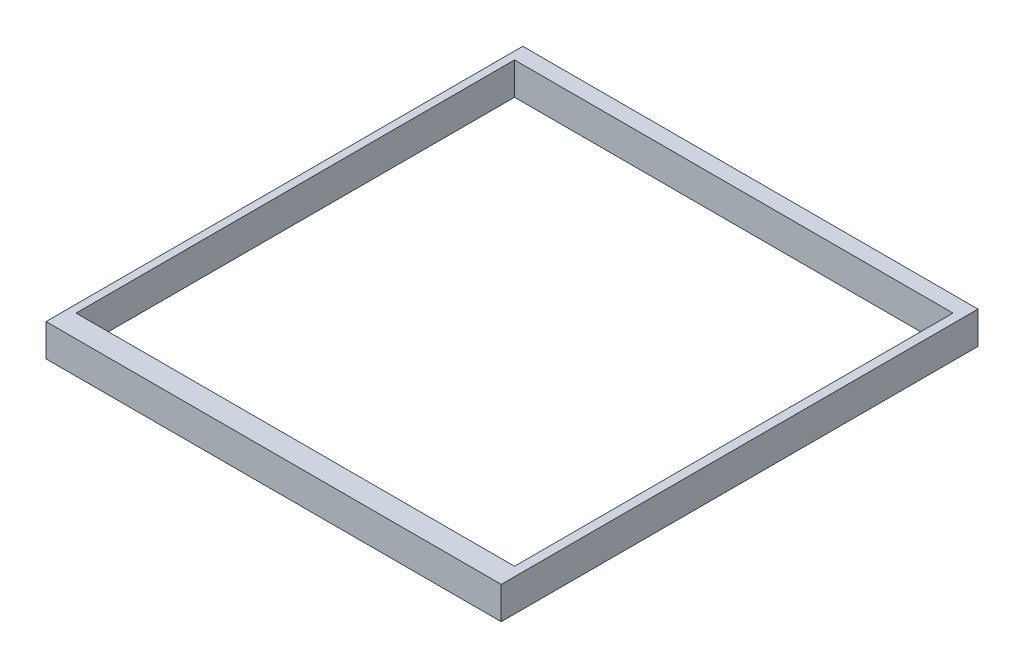
ISO-10303-21;
HEADER;
FILE_DESCRIPTION(('STEP AP214'),'2;1');
FILE_NAME('part.step','',(''),(''),'','','');
FILE_SCHEMA(('AUTOMOTIVE_DESIGN { 1 0 10303 214 1 1 1 1 }'));
ENDSEC;
DATA;
#1=APPLICATION_CONTEXT('core data for automotive mechanical design processes');
#2=APPLICATION_PROTOCOL_DEFINITION('international standard','automotive_design',2000,#1);
#3=PRODUCT_CONTEXT('',#1,'mechanical');
#4=PRODUCT('Part','Part','',(#3));
#5=PRODUCT_RELATED_PRODUCT_CATEGORY('part','',(#4));
#6=PRODUCT_DEFINITION_FORMATION('','',#4);
#7=PRODUCT_DEFINITION_CONTEXT('part definition',#1,'design');
#8=PRODUCT_DEFINITION('design','',#6,#7);
#9=PRODUCT_DEFINITION_SHAPE('','',#8);
#10=(LENGTH_UNIT() NAMED_UNIT(*) SI_UNIT(.MILLI.,.METRE.));
#11=(NAMED_UNIT(*) PLANE_ANGLE_UNIT() SI_UNIT($,.RADIAN.));
#12=(NAMED_UNIT(*) SI_UNIT($,.STERADIAN.) SOLID_ANGLE_UNIT());
#13=UNCERTAINTY_MEASURE_WITH_UNIT(LENGTH_MEASURE(1.E-05),#10,'distance_accuracy_value','');
#14=(GEOMETRIC_REPRESENTATION_CONTEXT(3) GLOBAL_UNCERTAINTY_ASSIGNED_CONTEXT((#13)) GLOBAL_UNIT_ASSIGNED_CONTEXT((#10,
#11,#12)) REPRESENTATION_CONTEXT('',''));
#15=CARTESIAN_POINT('',(0.,0.,0.));
#16=DIRECTION('',(0.,0.,1.));
#17=DIRECTION('',(1.,0.,0.));
#18=AXIS2_PLACEMENT_3D('',#15,#16,#17);
#19=CARTESIAN_POINT('',(226.14675687403,135.,99.528425477833));
#20=DIRECTION('',(0.,0.,-1.));
#21=DIRECTION('',(-1.,0.,0.));
#22=AXIS2_PLACEMENT_3D('',#19,#20,#21);
#23=PLANE('',#22);
#24=DIRECTION('',(1.,0.,0.));
#25=VECTOR('',#24,1.);
#26=CARTESIAN_POINT('',(226.14675687403,0.,99.528425477833));
#27=LINE('',#26,#25);
#28=CARTESIAN_POINT('',(226.14675687403,0.,99.528425477833));
#29=VERTEX_POINT('',#28);
#30=CARTESIAN_POINT('',(2126.14675687403,0.,99.528425477833));
#31=VERTEX_POINT('',#30);
#32=EDGE_CURVE('E125',#29,#31,#27,.T.);
#33=ORIENTED_EDGE('',*,*,#32,.F.);
#34=DIRECTION('',(0.,-1.,0.));
#35=VECTOR('',#34,1.);
#36=CARTESIAN_POINT('',(226.14675687403,135.,99.528425477833));
#37=LINE('',#36,#35);
#38=CARTESIAN_POINT('',(226.14675687403,135.,99.528425477833));
#39=VERTEX_POINT('',#38);
#40=EDGE_CURVE('E149',#39,#29,#37,.T.);
#41=ORIENTED_EDGE('',*,*,#40,.F.);
#42=DIRECTION('',(1.,0.,0.));
#43=VECTOR('',#42,1.);
#44=CARTESIAN_POINT('',(226.14675687403,135.,99.528425477833));
#45=LINE('',#44,#43);
#46=CARTESIAN_POINT('',(2126.14675687403,135.,99.528425477833));
#47=VERTEX_POINT('',#46);
#48=EDGE_CURVE('E128',#39,#47,#45,.T.);
#49=ORIENTED_EDGE('',*,*,#48,.T.);
#50=DIRECTION('',(0.,-1.,0.));
#51=VECTOR('',#50,1.);
#52=CARTESIAN_POINT('',(2126.14675687403,135.,99.528425477833));
#53=LINE('',#52,#51);
#54=EDGE_CURVE('E139',#47,#31,#53,.T.);
#55=ORIENTED_EDGE('',*,*,#54,.T.);
#56=EDGE_LOOP('',(#33,#41,#49,#55));
#57=FACE_BOUND('',#56,.T.);
#58=ADVANCED_FACE('F36',(#57),#23,.T.);
#59=CARTESIAN_POINT('',(226.14675687403,135.,99.528425477833));
#60=DIRECTION('',(1.,0.,0.));
#61=DIRECTION('',(0.,0.,-1.));
#62=AXIS2_PLACEMENT_3D('',#59,#60,#61);
#63=PLANE('',#62);
#64=DIRECTION('',(0.,0.,1.));
#65=VECTOR('',#64,1.);
#66=CARTESIAN_POINT('',(226.14675687403,0.,99.528425477833));
#67=LINE('',#66,#65);
#68=CARTESIAN_POINT('',(226.14675687403,0.,2089.52842547783));
#69=VERTEX_POINT('',#68);
#70=EDGE_CURVE('E132',#29,#69,#67,.T.);
#71=ORIENTED_EDGE('',*,*,#70,.T.);
#72=DIRECTION('',(0.,-1.,0.));
#73=VECTOR('',#72,1.);
#74=CARTESIAN_POINT('',(226.14675687403,135.,2089.52842547783));
#75=LINE('',#74,#73);
#76=CARTESIAN_POINT('',(226.14675687403,135.,2089.52842547783));
#77=VERTEX_POINT('',#76);
#78=EDGE_CURVE('E152',#77,#69,#75,.T.);
#79=ORIENTED_EDGE('',*,*,#78,.F.);
#80=DIRECTION('',(0.,0.,1.));
#81=VECTOR('',#80,1.);
#82=CARTESIAN_POINT('',(226.14675687403,135.,99.528425477833));
#83=LINE('',#82,#81);
#84=EDGE_CURVE('E137',#39,#77,#83,.T.);
#85=ORIENTED_EDGE('',*,*,#84,.F.);
#86=ORIENTED_EDGE('',*,*,#40,.T.);
#87=EDGE_LOOP('',(#71,#79,#85,#86));
#88=FACE_BOUND('',#87,.T.);
#89=ADVANCED_FACE('F179',(#88),#63,.F.);
#90=CARTESIAN_POINT('',(226.14675687403,135.,2089.52842547783));
#91=DIRECTION('',(0.,0.,-1.));
#92=DIRECTION('',(-1.,0.,0.));
#93=AXIS2_PLACEMENT_3D('',#90,#91,#92);
#94=PLANE('',#93);
#95=DIRECTION('',(1.,0.,0.));
#96=VECTOR('',#95,1.);
#97=CARTESIAN_POINT('',(226.14675687403,0.,2089.52842547783));
#98=LINE('',#97,#96);
#99=CARTESIAN_POINT('',(2126.14675687403,0.,2089.52842547783));
#100=VERTEX_POINT('',#99);
#101=EDGE_CURVE('E145',#69,#100,#98,.T.);
#102=ORIENTED_EDGE('',*,*,#101,.T.);
#103=DIRECTION('',(0.,-1.,0.));
#104=VECTOR('',#103,1.);
#105=CARTESIAN_POINT('',(2126.14675687403,135.,2089.52842547783));
#106=LINE('',#105,#104);
#107=CARTESIAN_POINT('',(2126.14675687403,135.,2089.52842547783));
#108=VERTEX_POINT('',#107);
#109=EDGE_CURVE('E155',#108,#100,#106,.T.);
#110=ORIENTED_EDGE('',*,*,#109,.F.);
#111=DIRECTION('',(1.,0.,0.));
#112=VECTOR('',#111,1.);
#113=CARTESIAN_POINT('',(226.14675687403,135.,2089.52842547783));
#114=LINE('',#113,#112);
#115=EDGE_CURVE('E135',#77,#108,#114,.T.);
#116=ORIENTED_EDGE('',*,*,#115,.F.);
#117=ORIENTED_EDGE('',*,*,#78,.T.);
#118=EDGE_LOOP('',(#102,#110,#116,#117));
#119=FACE_BOUND('',#118,.T.);
#120=ADVANCED_FACE('F184',(#119),#94,.F.);
#121=CARTESIAN_POINT('',(2126.14675687403,135.,99.528425477833));
#122=DIRECTION('',(1.,0.,0.));
#123=DIRECTION('',(0.,0.,-1.));
#124=AXIS2_PLACEMENT_3D('',#121,#122,#123);
#125=PLANE('',#124);
#126=DIRECTION('',(0.,0.,1.));
#127=VECTOR('',#126,1.);
#128=CARTESIAN_POINT('',(2126.14675687403,0.,99.528425477833));
#129=LINE('',#128,#127);
#130=EDGE_CURVE('E142',#31,#100,#129,.T.);
#131=ORIENTED_EDGE('',*,*,#130,.F.);
#132=ORIENTED_EDGE('',*,*,#54,.F.);
#133=DIRECTION('',(0.,0.,1.));
#134=VECTOR('',#133,1.);
#135=CARTESIAN_POINT('',(2126.14675687403,135.,99.528425477833));
#136=LINE('',#135,#134);
#137=EDGE_CURVE('E131',#47,#108,#136,.T.);
#138=ORIENTED_EDGE('',*,*,#137,.T.);
#139=ORIENTED_EDGE('',*,*,#109,.T.);
#140=EDGE_LOOP('',(#131,#132,#138,#139));
#141=FACE_BOUND('',#140,.T.);
#142=ADVANCED_FACE('F199',(#141),#125,.T.);
#143=CARTESIAN_POINT('',(0.,135.,0.));
#144=DIRECTION('',(0.,-1.,0.));
#145=DIRECTION('',(0.,0.,-1.));
#146=AXIS2_PLACEMENT_3D('',#143,#144,#145);
#147=PLANE('',#146);
#148=DIRECTION('',(0.,0.,-1.));
#149=VECTOR('',#148,1.);
#150=CARTESIAN_POINT('',(2088.33076797633,135.,1996.18200841011));
#151=LINE('',#150,#149);
#152=CARTESIAN_POINT('',(2088.33076797633,135.,1996.18200841011));
#153=VERTEX_POINT('',#152);
#154=CARTESIAN_POINT('',(2088.33076797633,135.,166.182008410114));
#155=VERTEX_POINT('',#154);
#156=EDGE_CURVE('E111',#153,#155,#151,.T.);
#157=ORIENTED_EDGE('',*,*,#156,.F.);
#158=DIRECTION('',(1.,0.,0.));
#159=VECTOR('',#158,1.);
#160=CARTESIAN_POINT('',(258.330767976329,135.,1996.18200841011));
#161=LINE('',#160,#159);
#162=CARTESIAN_POINT('',(258.330767976329,135.,1996.18200841011));
#163=VERTEX_POINT('',#162);
#164=EDGE_CURVE('E50',#163,#153,#161,.T.);
#165=ORIENTED_EDGE('',*,*,#164,.F.);
#166=DIRECTION('',(0.,0.,1.));
#167=VECTOR('',#166,1.);
#168=CARTESIAN_POINT('',(258.330767976329,135.,1996.18200841011));
#169=LINE('',#168,#167);
#170=CARTESIAN_POINT('',(258.330767976329,135.,166.182008410114));
#171=VERTEX_POINT('',#170);
#172=EDGE_CURVE('E118',#171,#163,#169,.T.);
#173=ORIENTED_EDGE('',*,*,#172,.F.);
#174=DIRECTION('',(-1.,0.,0.));
#175=VECTOR('',#174,1.);
#176=CARTESIAN_POINT('',(258.330767976329,135.,166.182008410114));
#177=LINE('',#176,#175);
#178=EDGE_CURVE('E102',#155,#171,#177,.T.);
#179=ORIENTED_EDGE('',*,*,#178,.F.);
#180=EDGE_LOOP('',(#157,#165,#173,#179));
#181=FACE_BOUND('',#180,.T.);
#182=ORIENTED_EDGE('',*,*,#48,.F.);
#183=ORIENTED_EDGE('',*,*,#84,.T.);
#184=ORIENTED_EDGE('',*,*,#115,.T.);
#185=ORIENTED_EDGE('',*,*,#137,.F.);
#186=EDGE_LOOP('',(#182,#183,#184,#185));
#187=FACE_BOUND('',#186,.T.);
#188=ADVANCED_FACE('F115',(#181,#187),#147,.F.);
#189=CARTESIAN_POINT('',(0.,0.,0.));
#190=DIRECTION('',(0.,-1.,0.));
#191=DIRECTION('',(0.,0.,-1.));
#192=AXIS2_PLACEMENT_3D('',#189,#190,#191);
#193=PLANE('',#192);
#194=DIRECTION('',(-1.,0.,0.));
#195=VECTOR('',#194,1.);
#196=CARTESIAN_POINT('',(2.42208440117967E-13,0.,1996.18200841011));
#197=LINE('',#196,#195);
#198=CARTESIAN_POINT('',(2088.33076797633,0.,1996.18200841011));
#199=VERTEX_POINT('',#198);
#200=CARTESIAN_POINT('',(258.330767976329,0.,1996.18200841011));
#201=VERTEX_POINT('',#200);
#202=EDGE_CURVE('E11',#199,#201,#197,.T.);
#203=ORIENTED_EDGE('',*,*,#202,.F.);
#204=DIRECTION('',(0.,0.,1.));
#205=VECTOR('',#204,1.);
#206=CARTESIAN_POINT('',(2088.33076797633,0.,0.));
#207=LINE('',#206,#205);
#208=CARTESIAN_POINT('',(2088.33076797633,0.,166.182008410114));
#209=VERTEX_POINT('',#208);
#210=EDGE_CURVE('E151',#209,#199,#207,.T.);
#211=ORIENTED_EDGE('',*,*,#210,.F.);
#212=DIRECTION('',(1.,0.,0.));
#213=VECTOR('',#212,1.);
#214=CARTESIAN_POINT('',(0.,0.,166.182008410114));
#215=LINE('',#214,#213);
#216=CARTESIAN_POINT('',(258.330767976329,0.,166.182008410114));
#217=VERTEX_POINT('',#216);
#218=EDGE_CURVE('E105',#217,#209,#215,.T.);
#219=ORIENTED_EDGE('',*,*,#218,.F.);
#220=DIRECTION('',(0.,0.,-1.));
#221=VECTOR('',#220,1.);
#222=CARTESIAN_POINT('',(258.330767976329,0.,0.));
#223=LINE('',#222,#221);
#224=EDGE_CURVE('E43',#201,#217,#223,.T.);
#225=ORIENTED_EDGE('',*,*,#224,.F.);
#226=EDGE_LOOP('',(#203,#211,#219,#225));
#227=FACE_BOUND('',#226,.T.);
#228=ORIENTED_EDGE('',*,*,#32,.T.);
#229=ORIENTED_EDGE('',*,*,#130,.T.);
#230=ORIENTED_EDGE('',*,*,#101,.F.);
#231=ORIENTED_EDGE('',*,*,#70,.F.);
#232=EDGE_LOOP('',(#228,#229,#230,#231));
#233=FACE_BOUND('',#232,.T.);
#234=ADVANCED_FACE('F165',(#227,#233),#193,.T.);
#235=CARTESIAN_POINT('',(258.330767976329,-310.,1996.18200841011));
#236=DIRECTION('',(0.,0.,1.));
#237=DIRECTION('',(1.,0.,0.));
#238=AXIS2_PLACEMENT_3D('',#235,#236,#237);
#239=PLANE('',#238);
#240=ORIENTED_EDGE('',*,*,#202,.T.);
#241=DIRECTION('',(0.,1.,0.));
#242=VECTOR('',#241,1.);
#243=CARTESIAN_POINT('',(258.330767976329,-310.,1996.18200841011));
#244=LINE('',#243,#242);
#245=EDGE_CURVE('E123',#201,#163,#244,.T.);
#246=ORIENTED_EDGE('',*,*,#245,.T.);
#247=ORIENTED_EDGE('',*,*,#164,.T.);
#248=DIRECTION('',(0.,1.,0.));
#249=VECTOR('',#248,1.);
#250=CARTESIAN_POINT('',(2088.33076797633,-310.,1996.18200841011));
#251=LINE('',#250,#249);
#252=EDGE_CURVE('E108',#199,#153,#251,.T.);
#253=ORIENTED_EDGE('',*,*,#252,.F.);
#254=EDGE_LOOP('',(#240,#246,#247,#253));
#255=FACE_BOUND('',#254,.T.);
#256=ADVANCED_FACE('F167',(#255),#239,.F.);
#257=CARTESIAN_POINT('',(258.330767976329,-310.,1996.18200841011));
#258=DIRECTION('',(-1.,0.,0.));
#259=DIRECTION('',(0.,0.,1.));
#260=AXIS2_PLACEMENT_3D('',#257,#258,#259);
#261=PLANE('',#260);
#262=ORIENTED_EDGE('',*,*,#224,.T.);
#263=DIRECTION('',(0.,1.,0.));
#264=VECTOR('',#263,1.);
#265=CARTESIAN_POINT('',(258.330767976329,-310.,166.182008410114));
#266=LINE('',#265,#264);
#267=EDGE_CURVE('E107',#217,#171,#266,.T.);
#268=ORIENTED_EDGE('',*,*,#267,.T.);
#269=ORIENTED_EDGE('',*,*,#172,.T.);
#270=ORIENTED_EDGE('',*,*,#245,.F.);
#271=EDGE_LOOP('',(#262,#268,#269,#270));
#272=FACE_BOUND('',#271,.T.);
#273=ADVANCED_FACE('F162',(#272),#261,.F.);
#274=CARTESIAN_POINT('',(258.330767976329,-310.,166.182008410114));
#275=DIRECTION('',(0.,0.,-1.));
#276=DIRECTION('',(-1.,0.,0.));
#277=AXIS2_PLACEMENT_3D('',#274,#275,#276);
#278=PLANE('',#277);
#279=ORIENTED_EDGE('',*,*,#218,.T.);
#280=DIRECTION('',(0.,1.,0.));
#281=VECTOR('',#280,1.);
#282=CARTESIAN_POINT('',(2088.33076797633,-310.,166.182008410114));
#283=LINE('',#282,#281);
#284=EDGE_CURVE('E58',#209,#155,#283,.T.);
#285=ORIENTED_EDGE('',*,*,#284,.T.);
#286=ORIENTED_EDGE('',*,*,#178,.T.);
#287=ORIENTED_EDGE('',*,*,#267,.F.);
#288=EDGE_LOOP('',(#279,#285,#286,#287));
#289=FACE_BOUND('',#288,.T.);
#290=ADVANCED_FACE('F99',(#289),#278,.F.);
#291=CARTESIAN_POINT('',(2088.33076797633,-310.,1996.18200841011));
#292=DIRECTION('',(1.,0.,0.));
#293=DIRECTION('',(0.,0.,-1.));
#294=AXIS2_PLACEMENT_3D('',#291,#292,#293);
#295=PLANE('',#294);
#296=ORIENTED_EDGE('',*,*,#210,.T.);
#297=ORIENTED_EDGE('',*,*,#252,.T.);
#298=ORIENTED_EDGE('',*,*,#156,.T.);
#299=ORIENTED_EDGE('',*,*,#284,.F.);
#300=EDGE_LOOP('',(#296,#297,#298,#299));
#301=FACE_BOUND('',#300,.T.);
#302=ADVANCED_FACE('F112',(#301),#295,.F.);
#303=CLOSED_SHELL('',(#58,#89,#120,#142,#188,#234,#256,#273,#290,#302));
#304=MANIFOLD_SOLID_BREP('B2',#303);
#305=ADVANCED_BREP_SHAPE_REPRESENTATION('',(#18,#304),#14);
#306=SHAPE_DEFINITION_REPRESENTATION(#9,#305);
ENDSEC;
END-ISO-10303-21;
